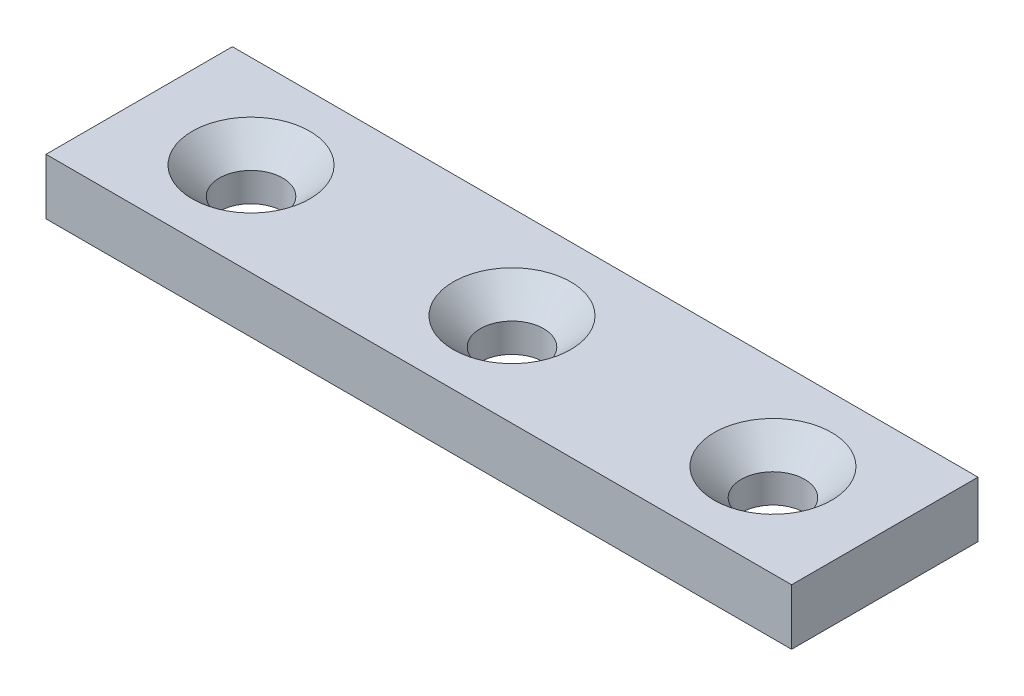
ISO-10303-21;
HEADER;
FILE_DESCRIPTION(('STEP AP214'),'2;1');
FILE_NAME('part.step','',(''),(''),'','','');
FILE_SCHEMA(('AUTOMOTIVE_DESIGN { 1 0 10303 214 1 1 1 1 }'));
ENDSEC;
DATA;
#1=APPLICATION_CONTEXT('core data for automotive mechanical design processes');
#2=APPLICATION_PROTOCOL_DEFINITION('international standard','automotive_design',2000,#1);
#3=PRODUCT_CONTEXT('',#1,'mechanical');
#4=PRODUCT('Part','Part','',(#3));
#5=PRODUCT_RELATED_PRODUCT_CATEGORY('part','',(#4));
#6=PRODUCT_DEFINITION_FORMATION('','',#4);
#7=PRODUCT_DEFINITION_CONTEXT('part definition',#1,'design');
#8=PRODUCT_DEFINITION('design','',#6,#7);
#9=PRODUCT_DEFINITION_SHAPE('','',#8);
#10=(LENGTH_UNIT() NAMED_UNIT(*) SI_UNIT(.MILLI.,.METRE.));
#11=(NAMED_UNIT(*) PLANE_ANGLE_UNIT() SI_UNIT($,.RADIAN.));
#12=(NAMED_UNIT(*) SI_UNIT($,.STERADIAN.) SOLID_ANGLE_UNIT());
#13=UNCERTAINTY_MEASURE_WITH_UNIT(LENGTH_MEASURE(1.E-05),#10,'distance_accuracy_value','');
#14=(GEOMETRIC_REPRESENTATION_CONTEXT(3) GLOBAL_UNCERTAINTY_ASSIGNED_CONTEXT((#13)) GLOBAL_UNIT_ASSIGNED_CONTEXT((#10,
#11,#12)) REPRESENTATION_CONTEXT('',''));
#15=CARTESIAN_POINT('',(0.,0.,0.));
#16=DIRECTION('',(0.,0.,1.));
#17=DIRECTION('',(1.,0.,0.));
#18=AXIS2_PLACEMENT_3D('',#15,#16,#17);
#19=CARTESIAN_POINT('',(20.,3.,5.));
#20=DIRECTION('',(-1.,0.,0.));
#21=DIRECTION('',(0.,0.,1.));
#22=AXIS2_PLACEMENT_3D('',#19,#20,#21);
#23=PLANE('',#22);
#24=DIRECTION('',(0.,0.,-1.));
#25=VECTOR('',#24,1.);
#26=CARTESIAN_POINT('',(20.,0.,5.));
#27=LINE('',#26,#25);
#28=CARTESIAN_POINT('',(20.,0.,5.));
#29=VERTEX_POINT('',#28);
#30=CARTESIAN_POINT('',(20.,0.,-5.));
#31=VERTEX_POINT('',#30);
#32=EDGE_CURVE('E98',#29,#31,#27,.T.);
#33=ORIENTED_EDGE('',*,*,#32,.T.);
#34=DIRECTION('',(0.,-1.,0.));
#35=VECTOR('',#34,1.);
#36=CARTESIAN_POINT('',(20.,3.,-5.));
#37=LINE('',#36,#35);
#38=CARTESIAN_POINT('',(20.,3.,-5.));
#39=VERTEX_POINT('',#38);
#40=EDGE_CURVE('E11',#39,#31,#37,.T.);
#41=ORIENTED_EDGE('',*,*,#40,.F.);
#42=DIRECTION('',(0.,0.,-1.));
#43=VECTOR('',#42,1.);
#44=CARTESIAN_POINT('',(20.,3.,5.));
#45=LINE('',#44,#43);
#46=CARTESIAN_POINT('',(20.,3.,5.));
#47=VERTEX_POINT('',#46);
#48=EDGE_CURVE('E86',#47,#39,#45,.T.);
#49=ORIENTED_EDGE('',*,*,#48,.F.);
#50=DIRECTION('',(0.,-1.,0.));
#51=VECTOR('',#50,1.);
#52=CARTESIAN_POINT('',(20.,3.,5.));
#53=LINE('',#52,#51);
#54=EDGE_CURVE('E94',#47,#29,#53,.T.);
#55=ORIENTED_EDGE('',*,*,#54,.T.);
#56=EDGE_LOOP('',(#33,#41,#49,#55));
#57=FACE_BOUND('',#56,.T.);
#58=ADVANCED_FACE('F35',(#57),#23,.F.);
#59=CARTESIAN_POINT('',(-20.,3.,-5.));
#60=DIRECTION('',(0.,0.,1.));
#61=DIRECTION('',(1.,0.,0.));
#62=AXIS2_PLACEMENT_3D('',#59,#60,#61);
#63=PLANE('',#62);
#64=DIRECTION('',(-1.,0.,0.));
#65=VECTOR('',#64,1.);
#66=CARTESIAN_POINT('',(-20.,0.,-5.));
#67=LINE('',#66,#65);
#68=CARTESIAN_POINT('',(-20.,0.,-5.));
#69=VERTEX_POINT('',#68);
#70=EDGE_CURVE('E90',#31,#69,#67,.T.);
#71=ORIENTED_EDGE('',*,*,#70,.T.);
#72=DIRECTION('',(0.,-1.,0.));
#73=VECTOR('',#72,1.);
#74=CARTESIAN_POINT('',(-20.,3.,-5.));
#75=LINE('',#74,#73);
#76=CARTESIAN_POINT('',(-20.,3.,-5.));
#77=VERTEX_POINT('',#76);
#78=EDGE_CURVE('E43',#77,#69,#75,.T.);
#79=ORIENTED_EDGE('',*,*,#78,.F.);
#80=DIRECTION('',(-1.,0.,0.));
#81=VECTOR('',#80,1.);
#82=CARTESIAN_POINT('',(-20.,3.,-5.));
#83=LINE('',#82,#81);
#84=EDGE_CURVE('E81',#39,#77,#83,.T.);
#85=ORIENTED_EDGE('',*,*,#84,.F.);
#86=ORIENTED_EDGE('',*,*,#40,.T.);
#87=EDGE_LOOP('',(#71,#79,#85,#86));
#88=FACE_BOUND('',#87,.T.);
#89=ADVANCED_FACE('F89',(#88),#63,.F.);
#90=CARTESIAN_POINT('',(-20.,3.,5.));
#91=DIRECTION('',(1.,0.,0.));
#92=DIRECTION('',(0.,0.,-1.));
#93=AXIS2_PLACEMENT_3D('',#90,#91,#92);
#94=PLANE('',#93);
#95=DIRECTION('',(0.,0.,1.));
#96=VECTOR('',#95,1.);
#97=CARTESIAN_POINT('',(-20.,0.,5.));
#98=LINE('',#97,#96);
#99=CARTESIAN_POINT('',(-20.,0.,5.));
#100=VERTEX_POINT('',#99);
#101=EDGE_CURVE('E68',#69,#100,#98,.T.);
#102=ORIENTED_EDGE('',*,*,#101,.T.);
#103=DIRECTION('',(0.,-1.,0.));
#104=VECTOR('',#103,1.);
#105=CARTESIAN_POINT('',(-20.,3.,5.));
#106=LINE('',#105,#104);
#107=CARTESIAN_POINT('',(-20.,3.,5.));
#108=VERTEX_POINT('',#107);
#109=EDGE_CURVE('E91',#108,#100,#106,.T.);
#110=ORIENTED_EDGE('',*,*,#109,.F.);
#111=DIRECTION('',(0.,0.,1.));
#112=VECTOR('',#111,1.);
#113=CARTESIAN_POINT('',(-20.,3.,5.));
#114=LINE('',#113,#112);
#115=EDGE_CURVE('E84',#77,#108,#114,.T.);
#116=ORIENTED_EDGE('',*,*,#115,.F.);
#117=ORIENTED_EDGE('',*,*,#78,.T.);
#118=EDGE_LOOP('',(#102,#110,#116,#117));
#119=FACE_BOUND('',#118,.T.);
#120=ADVANCED_FACE('F92',(#119),#94,.F.);
#121=CARTESIAN_POINT('',(-20.,3.,5.));
#122=DIRECTION('',(0.,0.,-1.));
#123=DIRECTION('',(-1.,0.,0.));
#124=AXIS2_PLACEMENT_3D('',#121,#122,#123);
#125=PLANE('',#124);
#126=DIRECTION('',(1.,0.,0.));
#127=VECTOR('',#126,1.);
#128=CARTESIAN_POINT('',(-20.,0.,5.));
#129=LINE('',#128,#127);
#130=EDGE_CURVE('E74',#100,#29,#129,.T.);
#131=ORIENTED_EDGE('',*,*,#130,.T.);
#132=ORIENTED_EDGE('',*,*,#54,.F.);
#133=DIRECTION('',(1.,0.,0.));
#134=VECTOR('',#133,1.);
#135=CARTESIAN_POINT('',(-20.,3.,5.));
#136=LINE('',#135,#134);
#137=EDGE_CURVE('E51',#108,#47,#136,.T.);
#138=ORIENTED_EDGE('',*,*,#137,.F.);
#139=ORIENTED_EDGE('',*,*,#109,.T.);
#140=EDGE_LOOP('',(#131,#132,#138,#139));
#141=FACE_BOUND('',#140,.T.);
#142=ADVANCED_FACE('F106',(#141),#125,.F.);
#143=CARTESIAN_POINT('',(0.,3.,0.));
#144=DIRECTION('',(0.,-1.,0.));
#145=DIRECTION('',(0.,0.,-1.));
#146=AXIS2_PLACEMENT_3D('',#143,#144,#145);
#147=PLANE('',#146);
#148=CARTESIAN_POINT('',(-14.,3.,0.));
#149=DIRECTION('',(0.,1.,0.));
#150=DIRECTION('',(0.,0.,1.));
#151=AXIS2_PLACEMENT_3D('',#148,#149,#150);
#152=CIRCLE('',#151,3.15);
#153=CARTESIAN_POINT('',(-14.,3.,3.15));
#154=VERTEX_POINT('',#153);
#155=EDGE_CURVE('E135',#154,#154,#152,.T.);
#156=ORIENTED_EDGE('',*,*,#155,.F.);
#157=EDGE_LOOP('',(#156));
#158=FACE_BOUND('',#157,.T.);
#159=CARTESIAN_POINT('',(14.,3.,0.));
#160=DIRECTION('',(0.,1.,0.));
#161=DIRECTION('',(0.,0.,1.));
#162=AXIS2_PLACEMENT_3D('',#159,#160,#161);
#163=CIRCLE('',#162,3.15);
#164=CARTESIAN_POINT('',(14.,3.,3.14999999999999));
#165=VERTEX_POINT('',#164);
#166=EDGE_CURVE('E126',#165,#165,#163,.T.);
#167=ORIENTED_EDGE('',*,*,#166,.F.);
#168=EDGE_LOOP('',(#167));
#169=FACE_BOUND('',#168,.T.);
#170=CARTESIAN_POINT('',(0.,3.,0.));
#171=DIRECTION('',(0.,1.,0.));
#172=DIRECTION('',(0.,0.,1.));
#173=AXIS2_PLACEMENT_3D('',#170,#171,#172);
#174=CIRCLE('',#173,3.15);
#175=CARTESIAN_POINT('',(0.,3.,3.15));
#176=VERTEX_POINT('',#175);
#177=EDGE_CURVE('E117',#176,#176,#174,.T.);
#178=ORIENTED_EDGE('',*,*,#177,.F.);
#179=EDGE_LOOP('',(#178));
#180=FACE_BOUND('',#179,.T.);
#181=ORIENTED_EDGE('',*,*,#48,.T.);
#182=ORIENTED_EDGE('',*,*,#84,.T.);
#183=ORIENTED_EDGE('',*,*,#115,.T.);
#184=ORIENTED_EDGE('',*,*,#137,.T.);
#185=EDGE_LOOP('',(#181,#182,#183,#184));
#186=FACE_BOUND('',#185,.T.);
#187=ADVANCED_FACE('F82',(#158,#169,#180,#186),#147,.F.);
#188=CARTESIAN_POINT('',(0.,0.,0.));
#189=DIRECTION('',(0.,-1.,0.));
#190=DIRECTION('',(0.,0.,-1.));
#191=AXIS2_PLACEMENT_3D('',#188,#189,#190);
#192=PLANE('',#191);
#193=CARTESIAN_POINT('',(-14.,0.,0.));
#194=DIRECTION('',(0.,1.,0.));
#195=DIRECTION('',(0.,0.,1.));
#196=AXIS2_PLACEMENT_3D('',#193,#194,#195);
#197=CIRCLE('',#196,1.7);
#198=CARTESIAN_POINT('',(-14.,0.,1.7));
#199=VERTEX_POINT('',#198);
#200=EDGE_CURVE('E129',#199,#199,#197,.T.);
#201=ORIENTED_EDGE('',*,*,#200,.T.);
#202=EDGE_LOOP('',(#201));
#203=FACE_BOUND('',#202,.T.);
#204=CARTESIAN_POINT('',(14.,0.,0.));
#205=DIRECTION('',(0.,1.,0.));
#206=DIRECTION('',(0.,0.,1.));
#207=AXIS2_PLACEMENT_3D('',#204,#205,#206);
#208=CIRCLE('',#207,1.7);
#209=CARTESIAN_POINT('',(14.,0.,1.69999999999999));
#210=VERTEX_POINT('',#209);
#211=EDGE_CURVE('E120',#210,#210,#208,.T.);
#212=ORIENTED_EDGE('',*,*,#211,.T.);
#213=EDGE_LOOP('',(#212));
#214=FACE_BOUND('',#213,.T.);
#215=CARTESIAN_POINT('',(0.,0.,0.));
#216=DIRECTION('',(0.,1.,0.));
#217=DIRECTION('',(0.,0.,1.));
#218=AXIS2_PLACEMENT_3D('',#215,#216,#217);
#219=CIRCLE('',#218,1.7);
#220=CARTESIAN_POINT('',(0.,0.,1.7));
#221=VERTEX_POINT('',#220);
#222=EDGE_CURVE('E101',#221,#221,#219,.T.);
#223=ORIENTED_EDGE('',*,*,#222,.T.);
#224=EDGE_LOOP('',(#223));
#225=FACE_BOUND('',#224,.T.);
#226=ORIENTED_EDGE('',*,*,#32,.F.);
#227=ORIENTED_EDGE('',*,*,#130,.F.);
#228=ORIENTED_EDGE('',*,*,#101,.F.);
#229=ORIENTED_EDGE('',*,*,#70,.F.);
#230=EDGE_LOOP('',(#226,#227,#228,#229));
#231=FACE_BOUND('',#230,.T.);
#232=ADVANCED_FACE('F109',(#203,#214,#225,#231),#192,.T.);
#233=CARTESIAN_POINT('',(0.,3.,0.));
#234=DIRECTION('',(0.,1.,0.));
#235=DIRECTION('',(0.,0.,1.));
#236=AXIS2_PLACEMENT_3D('',#233,#234,#235);
#237=CYLINDRICAL_SURFACE('',#236,1.7);
#238=ORIENTED_EDGE('',*,*,#222,.F.);
#239=EDGE_LOOP('',(#238));
#240=FACE_BOUND('',#239,.T.);
#241=CARTESIAN_POINT('',(0.,1.55,0.));
#242=DIRECTION('',(0.,1.,0.));
#243=DIRECTION('',(0.,0.,1.));
#244=AXIS2_PLACEMENT_3D('',#241,#242,#243);
#245=CIRCLE('',#244,1.7);
#246=CARTESIAN_POINT('',(0.,1.55,1.7));
#247=VERTEX_POINT('',#246);
#248=EDGE_CURVE('E114',#247,#247,#245,.T.);
#249=ORIENTED_EDGE('',*,*,#248,.T.);
#250=EDGE_LOOP('',(#249));
#251=FACE_BOUND('',#250,.T.);
#252=ADVANCED_FACE('F151',(#240,#251),#237,.F.);
#253=CARTESIAN_POINT('',(0.,3.,0.));
#254=DIRECTION('',(0.,1.,0.));
#255=DIRECTION('',(0.,0.,1.));
#256=AXIS2_PLACEMENT_3D('',#253,#254,#255);
#257=CONICAL_SURFACE('',#256,3.15,0.785398163397447);
#258=ORIENTED_EDGE('',*,*,#248,.F.);
#259=EDGE_LOOP('',(#258));
#260=FACE_BOUND('',#259,.T.);
#261=ORIENTED_EDGE('',*,*,#177,.T.);
#262=EDGE_LOOP('',(#261));
#263=FACE_BOUND('',#262,.T.);
#264=ADVANCED_FACE('F148',(#260,#263),#257,.F.);
#265=CARTESIAN_POINT('',(14.,3.,0.));
#266=DIRECTION('',(0.,1.,0.));
#267=DIRECTION('',(0.,0.,1.));
#268=AXIS2_PLACEMENT_3D('',#265,#266,#267);
#269=CYLINDRICAL_SURFACE('',#268,1.7);
#270=ORIENTED_EDGE('',*,*,#211,.F.);
#271=EDGE_LOOP('',(#270));
#272=FACE_BOUND('',#271,.T.);
#273=CARTESIAN_POINT('',(14.,1.55,0.));
#274=DIRECTION('',(0.,1.,0.));
#275=DIRECTION('',(0.,0.,1.));
#276=AXIS2_PLACEMENT_3D('',#273,#274,#275);
#277=CIRCLE('',#276,1.7);
#278=CARTESIAN_POINT('',(14.,1.55,1.69999999999999));
#279=VERTEX_POINT('',#278);
#280=EDGE_CURVE('E123',#279,#279,#277,.T.);
#281=ORIENTED_EDGE('',*,*,#280,.T.);
#282=EDGE_LOOP('',(#281));
#283=FACE_BOUND('',#282,.T.);
#284=ADVANCED_FACE('F150',(#272,#283),#269,.F.);
#285=CARTESIAN_POINT('',(14.,3.,0.));
#286=DIRECTION('',(0.,1.,0.));
#287=DIRECTION('',(0.,0.,1.));
#288=AXIS2_PLACEMENT_3D('',#285,#286,#287);
#289=CONICAL_SURFACE('',#288,3.15,0.785398163397447);
#290=ORIENTED_EDGE('',*,*,#280,.F.);
#291=EDGE_LOOP('',(#290));
#292=FACE_BOUND('',#291,.T.);
#293=ORIENTED_EDGE('',*,*,#166,.T.);
#294=EDGE_LOOP('',(#293));
#295=FACE_BOUND('',#294,.T.);
#296=ADVANCED_FACE('F158',(#292,#295),#289,.F.);
#297=CARTESIAN_POINT('',(-14.,3.,0.));
#298=DIRECTION('',(0.,1.,0.));
#299=DIRECTION('',(0.,0.,1.));
#300=AXIS2_PLACEMENT_3D('',#297,#298,#299);
#301=CYLINDRICAL_SURFACE('',#300,1.7);
#302=ORIENTED_EDGE('',*,*,#200,.F.);
#303=EDGE_LOOP('',(#302));
#304=FACE_BOUND('',#303,.T.);
#305=CARTESIAN_POINT('',(-14.,1.55,0.));
#306=DIRECTION('',(0.,1.,0.));
#307=DIRECTION('',(0.,0.,1.));
#308=AXIS2_PLACEMENT_3D('',#305,#306,#307);
#309=CIRCLE('',#308,1.7);
#310=CARTESIAN_POINT('',(-14.,1.55,1.7));
#311=VERTEX_POINT('',#310);
#312=EDGE_CURVE('E132',#311,#311,#309,.T.);
#313=ORIENTED_EDGE('',*,*,#312,.T.);
#314=EDGE_LOOP('',(#313));
#315=FACE_BOUND('',#314,.T.);
#316=ADVANCED_FACE('F191',(#304,#315),#301,.F.);
#317=CARTESIAN_POINT('',(-14.,3.,0.));
#318=DIRECTION('',(0.,1.,0.));
#319=DIRECTION('',(0.,0.,1.));
#320=AXIS2_PLACEMENT_3D('',#317,#318,#319);
#321=CONICAL_SURFACE('',#320,3.15,0.785398163397448);
#322=ORIENTED_EDGE('',*,*,#312,.F.);
#323=EDGE_LOOP('',(#322));
#324=FACE_BOUND('',#323,.T.);
#325=ORIENTED_EDGE('',*,*,#155,.T.);
#326=EDGE_LOOP('',(#325));
#327=FACE_BOUND('',#326,.T.);
#328=ADVANCED_FACE('F139',(#324,#327),#321,.F.);
#329=CLOSED_SHELL('',(#58,#89,#120,#142,#187,#232,#252,#264,#284,#296,#316,#328));
#330=MANIFOLD_SOLID_BREP('B2',#329);
#331=ADVANCED_BREP_SHAPE_REPRESENTATION('',(#18,#330),#14);
#332=SHAPE_DEFINITION_REPRESENTATION(#9,#331);
ENDSEC;
END-ISO-10303-21;
